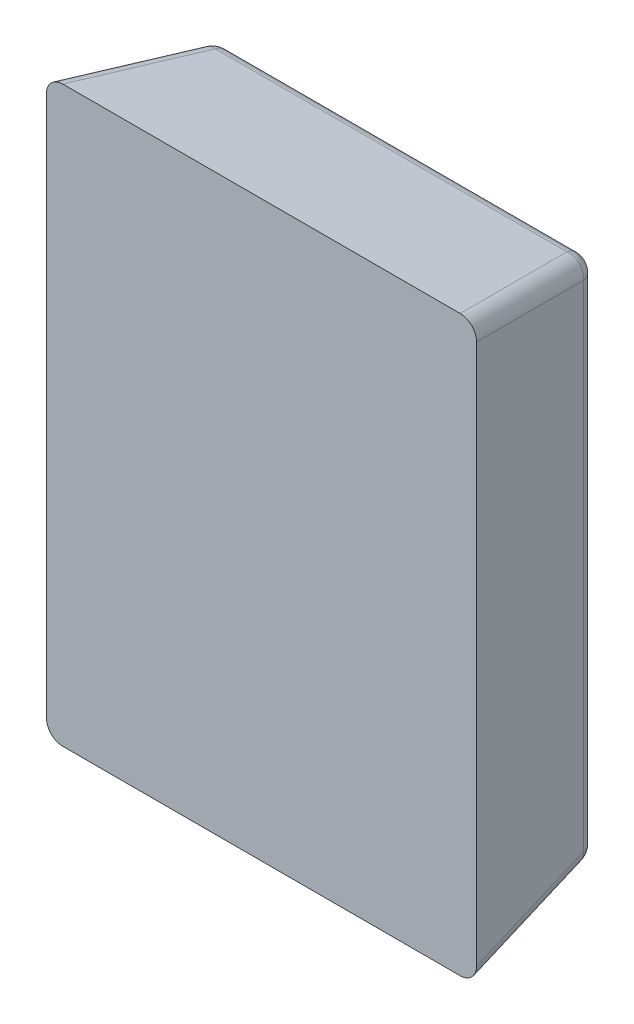
ISO-10303-21;
HEADER;
FILE_DESCRIPTION(('STEP AP214'),'2;1');
FILE_NAME('part.step','',(''),(''),'','','');
FILE_SCHEMA(('AUTOMOTIVE_DESIGN { 1 0 10303 214 1 1 1 1 }'));
ENDSEC;
DATA;
#1=APPLICATION_CONTEXT('core data for automotive mechanical design processes');
#2=APPLICATION_PROTOCOL_DEFINITION('international standard','automotive_design',2000,#1);
#3=PRODUCT_CONTEXT('',#1,'mechanical');
#4=PRODUCT('Part','Part','',(#3));
#5=PRODUCT_RELATED_PRODUCT_CATEGORY('part','',(#4));
#6=PRODUCT_DEFINITION_FORMATION('','',#4);
#7=PRODUCT_DEFINITION_CONTEXT('part definition',#1,'design');
#8=PRODUCT_DEFINITION('design','',#6,#7);
#9=PRODUCT_DEFINITION_SHAPE('','',#8);
#10=(LENGTH_UNIT() NAMED_UNIT(*) SI_UNIT(.MILLI.,.METRE.));
#11=(NAMED_UNIT(*) PLANE_ANGLE_UNIT() SI_UNIT($,.RADIAN.));
#12=(NAMED_UNIT(*) SI_UNIT($,.STERADIAN.) SOLID_ANGLE_UNIT());
#13=UNCERTAINTY_MEASURE_WITH_UNIT(LENGTH_MEASURE(1.E-05),#10,'distance_accuracy_value','');
#14=(GEOMETRIC_REPRESENTATION_CONTEXT(3) GLOBAL_UNCERTAINTY_ASSIGNED_CONTEXT((#13)) GLOBAL_UNIT_ASSIGNED_CONTEXT((#10,
#11,#12)) REPRESENTATION_CONTEXT('',''));
#15=CARTESIAN_POINT('',(0.,0.,0.));
#16=DIRECTION('',(0.,0.,1.));
#17=DIRECTION('',(1.,0.,0.));
#18=AXIS2_PLACEMENT_3D('',#15,#16,#17);
#19=CARTESIAN_POINT('',(0.464535714690616,-0.641019643054923,0.105));
#20=DIRECTION('',(0.,0.,-1.));
#21=DIRECTION('',(-1.,0.,0.));
#22=AXIS2_PLACEMENT_3D('',#19,#20,#21);
#23=PLANE('',#22);
#24=DIRECTION('',(0.,-1.,0.));
#25=VECTOR('',#24,1.);
#26=CARTESIAN_POINT('',(0.538082398429868,-0.701017157850477,0.105));
#27=LINE('',#26,#25);
#28=CARTESIAN_POINT('',(0.538082398429869,-0.744561356385283,0.105));
#29=VERTEX_POINT('',#28);
#30=CARTESIAN_POINT('',(0.538082398429868,-0.537477929724562,0.105));
#31=VERTEX_POINT('',#30);
#32=EDGE_CURVE('E134',#29,#31,#27,.F.);
#33=ORIENTED_EDGE('',*,*,#32,.F.);
#34=DIRECTION('',(-1.,0.,0.));
#35=VECTOR('',#34,1.);
#36=CARTESIAN_POINT('',(0.419535714690616,-0.744561356385283,0.105));
#37=LINE('',#36,#35);
#38=CARTESIAN_POINT('',(0.390989030951365,-0.744561356385283,0.105));
#39=VERTEX_POINT('',#38);
#40=EDGE_CURVE('E237',#39,#29,#37,.F.);
#41=ORIENTED_EDGE('',*,*,#40,.F.);
#42=DIRECTION('',(0.,1.,0.));
#43=VECTOR('',#42,1.);
#44=CARTESIAN_POINT('',(0.390989030951365,-0.581022128259368,0.105));
#45=LINE('',#44,#43);
#46=CARTESIAN_POINT('',(0.390989030951365,-0.537477929724562,0.105));
#47=VERTEX_POINT('',#46);
#48=EDGE_CURVE('E140',#47,#39,#45,.F.);
#49=ORIENTED_EDGE('',*,*,#48,.F.);
#50=DIRECTION('',(1.,0.,0.));
#51=VECTOR('',#50,1.);
#52=CARTESIAN_POINT('',(0.509535714690617,-0.537477929724562,0.105));
#53=LINE('',#52,#51);
#54=EDGE_CURVE('E114',#31,#47,#53,.F.);
#55=ORIENTED_EDGE('',*,*,#54,.F.);
#56=EDGE_LOOP('',(#33,#41,#49,#55));
#57=FACE_BOUND('',#56,.T.);
#58=ADVANCED_FACE('F17',(#57),#23,.T.);
#59=CARTESIAN_POINT('',(0.390989030951365,-0.581022128259368,0.112));
#60=DIRECTION('',(0.,1.,0.));
#61=DIRECTION('',(-1.,0.,0.));
#62=AXIS2_PLACEMENT_3D('',#59,#60,#61);
#63=CYLINDRICAL_SURFACE('',#62,0.007);
#64=DIRECTION('',(0.,1.,0.));
#65=VECTOR('',#64,1.);
#66=CARTESIAN_POINT('',(0.384095376680279,-0.521024613463813,0.110784462756331));
#67=LINE('',#66,#65);
#68=CARTESIAN_POINT('',(0.38409537668028,-0.537477929724562,0.110784462756331));
#69=VERTEX_POINT('',#68);
#70=CARTESIAN_POINT('',(0.38409537668028,-0.744561356385283,0.110784462756331));
#71=VERTEX_POINT('',#70);
#72=EDGE_CURVE('E183',#69,#71,#67,.F.);
#73=ORIENTED_EDGE('',*,*,#72,.F.);
#74=CARTESIAN_POINT('',(0.390989030951365,-0.537477929724562,0.112));
#75=DIRECTION('',(0.,1.,0.));
#76=DIRECTION('',(1.,0.,0.));
#77=AXIS2_PLACEMENT_3D('',#74,#75,#76);
#78=CIRCLE('',#77,0.007);
#79=EDGE_CURVE('E103',#47,#69,#78,.T.);
#80=ORIENTED_EDGE('',*,*,#79,.F.);
#81=ORIENTED_EDGE('',*,*,#48,.T.);
#82=CARTESIAN_POINT('',(0.390989030951366,-0.744561356385283,0.112));
#83=DIRECTION('',(0.,1.,0.));
#84=DIRECTION('',(1.,0.,0.));
#85=AXIS2_PLACEMENT_3D('',#82,#83,#84);
#86=CIRCLE('',#85,0.007);
#87=EDGE_CURVE('E90',#71,#39,#86,.F.);
#88=ORIENTED_EDGE('',*,*,#87,.F.);
#89=EDGE_LOOP('',(#73,#80,#81,#88));
#90=FACE_BOUND('',#89,.T.);
#91=ADVANCED_FACE('F229',(#90),#63,.T.);
#92=CARTESIAN_POINT('',(0.390989030951365,-0.537477929724562,0.112));
#93=DIRECTION('',(1.,0.,0.));
#94=DIRECTION('',(0.,1.,0.));
#95=AXIS2_PLACEMENT_3D('',#92,#93,#94);
#96=SPHERICAL_SURFACE('',#95,0.007);
#97=ORIENTED_EDGE('',*,*,#79,.T.);
#98=CARTESIAN_POINT('',(0.390989030951366,-0.537477929724562,0.112));
#99=DIRECTION('',(-0.17108786974604,0.171087869746041,0.970287525247812));
#100=DIRECTION('',(0.,-0.984807753012207,0.173648177666936));
#101=AXIS2_PLACEMENT_3D('',#98,#99,#100);
#102=CIRCLE('',#101,0.007);
#103=CARTESIAN_POINT('',(0.390989030951365,-0.530584275453477,0.110784462756331));
#104=VERTEX_POINT('',#103);
#105=EDGE_CURVE('E20',#104,#69,#102,.T.);
#106=ORIENTED_EDGE('',*,*,#105,.F.);
#107=CARTESIAN_POINT('',(0.390989030951365,-0.537477929724562,0.112));
#108=DIRECTION('',(1.,0.,0.));
#109=DIRECTION('',(0.,1.,0.));
#110=AXIS2_PLACEMENT_3D('',#107,#108,#109);
#111=CIRCLE('',#110,0.007);
#112=EDGE_CURVE('E122',#47,#104,#111,.T.);
#113=ORIENTED_EDGE('',*,*,#112,.F.);
#114=EDGE_LOOP('',(#97,#106,#113));
#115=FACE_BOUND('',#114,.T.);
#116=ADVANCED_FACE('F226',(#115),#96,.T.);
#117=CARTESIAN_POINT('',(0.509535714690617,-0.537477929724562,0.112));
#118=DIRECTION('',(1.,0.,0.));
#119=DIRECTION('',(0.,1.,0.));
#120=AXIS2_PLACEMENT_3D('',#117,#118,#119);
#121=CYLINDRICAL_SURFACE('',#120,0.007);
#122=DIRECTION('',(1.,0.,0.));
#123=VECTOR('',#122,1.);
#124=CARTESIAN_POINT('',(0.554535714690617,-0.530584275453476,0.110784462756331));
#125=LINE('',#124,#123);
#126=CARTESIAN_POINT('',(0.538082398429868,-0.530584275453476,0.110784462756331));
#127=VERTEX_POINT('',#126);
#128=EDGE_CURVE('E117',#127,#104,#125,.F.);
#129=ORIENTED_EDGE('',*,*,#128,.F.);
#130=CARTESIAN_POINT('',(0.538082398429868,-0.537477929724562,0.112));
#131=DIRECTION('',(1.,0.,0.));
#132=DIRECTION('',(0.,1.,0.));
#133=AXIS2_PLACEMENT_3D('',#130,#131,#132);
#134=CIRCLE('',#133,0.00699999999999995);
#135=EDGE_CURVE('E110',#31,#127,#134,.T.);
#136=ORIENTED_EDGE('',*,*,#135,.F.);
#137=ORIENTED_EDGE('',*,*,#54,.T.);
#138=ORIENTED_EDGE('',*,*,#112,.T.);
#139=EDGE_LOOP('',(#129,#136,#137,#138));
#140=FACE_BOUND('',#139,.T.);
#141=ADVANCED_FACE('F112',(#140),#121,.T.);
#142=CARTESIAN_POINT('',(0.538082398429868,-0.537477929724562,0.112));
#143=DIRECTION('',(1.,0.,0.));
#144=DIRECTION('',(0.,1.,0.));
#145=AXIS2_PLACEMENT_3D('',#142,#143,#144);
#146=SPHERICAL_SURFACE('',#145,0.007);
#147=ORIENTED_EDGE('',*,*,#135,.T.);
#148=CARTESIAN_POINT('',(0.538082398429869,-0.537477929724561,0.111999999999999));
#149=DIRECTION('',(0.171087869746028,0.171087869746031,0.970287525247816));
#150=DIRECTION('',(0.,-0.984807753012209,0.173648177666926));
#151=AXIS2_PLACEMENT_3D('',#148,#149,#150);
#152=CIRCLE('',#151,0.007);
#153=CARTESIAN_POINT('',(0.544976052700953,-0.537477929724562,0.110784462756331));
#154=VERTEX_POINT('',#153);
#155=EDGE_CURVE('E126',#154,#127,#152,.T.);
#156=ORIENTED_EDGE('',*,*,#155,.F.);
#157=CARTESIAN_POINT('',(0.538082398429868,-0.537477929724562,0.112));
#158=DIRECTION('',(0.,-1.,0.));
#159=DIRECTION('',(1.,0.,0.));
#160=AXIS2_PLACEMENT_3D('',#157,#158,#159);
#161=CIRCLE('',#160,0.007);
#162=EDGE_CURVE('E121',#31,#154,#161,.T.);
#163=ORIENTED_EDGE('',*,*,#162,.F.);
#164=EDGE_LOOP('',(#147,#156,#163));
#165=FACE_BOUND('',#164,.T.);
#166=ADVANCED_FACE('F125',(#165),#146,.T.);
#167=CARTESIAN_POINT('',(0.538082398429868,-0.701017157850477,0.112));
#168=DIRECTION('',(0.,-1.,0.));
#169=DIRECTION('',(1.,0.,0.));
#170=AXIS2_PLACEMENT_3D('',#167,#168,#169);
#171=CYLINDRICAL_SURFACE('',#170,0.007);
#172=DIRECTION('',(0.,1.,0.));
#173=VECTOR('',#172,1.);
#174=CARTESIAN_POINT('',(0.544976052700954,-0.761014672646032,0.110784462756331));
#175=LINE('',#174,#173);
#176=CARTESIAN_POINT('',(0.544976052700954,-0.744561356385283,0.110784462756331));
#177=VERTEX_POINT('',#176);
#178=EDGE_CURVE('E165',#177,#154,#175,.T.);
#179=ORIENTED_EDGE('',*,*,#178,.F.);
#180=CARTESIAN_POINT('',(0.538082398429869,-0.744561356385283,0.112));
#181=DIRECTION('',(0.,1.,0.));
#182=DIRECTION('',(1.,0.,0.));
#183=AXIS2_PLACEMENT_3D('',#180,#181,#182);
#184=CIRCLE('',#183,0.007);
#185=EDGE_CURVE('E131',#29,#177,#184,.F.);
#186=ORIENTED_EDGE('',*,*,#185,.F.);
#187=ORIENTED_EDGE('',*,*,#32,.T.);
#188=ORIENTED_EDGE('',*,*,#162,.T.);
#189=EDGE_LOOP('',(#179,#186,#187,#188));
#190=FACE_BOUND('',#189,.T.);
#191=ADVANCED_FACE('F135',(#190),#171,.T.);
#192=CARTESIAN_POINT('',(0.538082398429869,-0.744561356385283,0.112));
#193=DIRECTION('',(1.,0.,0.));
#194=DIRECTION('',(0.,1.,0.));
#195=AXIS2_PLACEMENT_3D('',#192,#193,#194);
#196=SPHERICAL_SURFACE('',#195,0.007);
#197=CARTESIAN_POINT('',(0.538082398429869,-0.744561356385283,0.112));
#198=DIRECTION('',(-1.,0.,0.));
#199=DIRECTION('',(0.,-1.,0.));
#200=AXIS2_PLACEMENT_3D('',#197,#198,#199);
#201=CIRCLE('',#200,0.007);
#202=CARTESIAN_POINT('',(0.538082398429869,-0.751455010656368,0.110784462756331));
#203=VERTEX_POINT('',#202);
#204=EDGE_CURVE('E216',#29,#203,#201,.T.);
#205=ORIENTED_EDGE('',*,*,#204,.F.);
#206=ORIENTED_EDGE('',*,*,#185,.T.);
#207=CARTESIAN_POINT('',(0.538082398429869,-0.744561356385283,0.112));
#208=DIRECTION('',(0.171087869746032,-0.171087869746034,0.970287525247815));
#209=DIRECTION('',(0.,-0.984807753012208,-0.173648177666929));
#210=AXIS2_PLACEMENT_3D('',#207,#208,#209);
#211=CIRCLE('',#210,0.007);
#212=EDGE_CURVE('E162',#203,#177,#211,.T.);
#213=ORIENTED_EDGE('',*,*,#212,.F.);
#214=EDGE_LOOP('',(#205,#206,#213));
#215=FACE_BOUND('',#214,.T.);
#216=ADVANCED_FACE('F204',(#215),#196,.T.);
#217=CARTESIAN_POINT('',(0.419535714690616,-0.744561356385283,0.112));
#218=DIRECTION('',(-1.,0.,0.));
#219=DIRECTION('',(0.,-1.,0.));
#220=AXIS2_PLACEMENT_3D('',#217,#218,#219);
#221=CYLINDRICAL_SURFACE('',#220,0.007);
#222=DIRECTION('',(1.,0.,0.));
#223=VECTOR('',#222,1.);
#224=CARTESIAN_POINT('',(0.374535714690617,-0.751455010656368,0.110784462756331));
#225=LINE('',#224,#223);
#226=CARTESIAN_POINT('',(0.390989030951366,-0.751455010656369,0.110784462756331));
#227=VERTEX_POINT('',#226);
#228=EDGE_CURVE('E163',#227,#203,#225,.T.);
#229=ORIENTED_EDGE('',*,*,#228,.F.);
#230=CARTESIAN_POINT('',(0.390989030951366,-0.744561356385283,0.112));
#231=DIRECTION('',(1.,0.,0.));
#232=DIRECTION('',(0.,1.,0.));
#233=AXIS2_PLACEMENT_3D('',#230,#231,#232);
#234=CIRCLE('',#233,0.00699999999999995);
#235=EDGE_CURVE('E98',#39,#227,#234,.F.);
#236=ORIENTED_EDGE('',*,*,#235,.F.);
#237=ORIENTED_EDGE('',*,*,#40,.T.);
#238=ORIENTED_EDGE('',*,*,#204,.T.);
#239=EDGE_LOOP('',(#229,#236,#237,#238));
#240=FACE_BOUND('',#239,.T.);
#241=ADVANCED_FACE('F199',(#240),#221,.T.);
#242=CARTESIAN_POINT('',(0.390989030951366,-0.744561356385283,0.112));
#243=DIRECTION('',(1.,0.,0.));
#244=DIRECTION('',(0.,1.,0.));
#245=AXIS2_PLACEMENT_3D('',#242,#243,#244);
#246=SPHERICAL_SURFACE('',#245,0.007);
#247=ORIENTED_EDGE('',*,*,#87,.T.);
#248=ORIENTED_EDGE('',*,*,#235,.T.);
#249=CARTESIAN_POINT('',(0.390989030951366,-0.744561356385283,0.112));
#250=DIRECTION('',(-0.171087869746039,-0.171087869746042,0.970287525247812));
#251=DIRECTION('',(0.,-0.984807753012207,-0.173648177666937));
#252=AXIS2_PLACEMENT_3D('',#249,#250,#251);
#253=CIRCLE('',#252,0.007);
#254=EDGE_CURVE('E158',#71,#227,#253,.T.);
#255=ORIENTED_EDGE('',*,*,#254,.F.);
#256=EDGE_LOOP('',(#247,#248,#255));
#257=FACE_BOUND('',#256,.T.);
#258=ADVANCED_FACE('F194',(#257),#246,.T.);
#259=CARTESIAN_POINT('',(0.374535714690616,-0.521024613463813,0.165));
#260=DIRECTION('',(-0.984807753012208,0.,-0.173648177666929));
#261=DIRECTION('',(-0.173648177666929,0.,0.984807753012208));
#262=AXIS2_PLACEMENT_3D('',#259,#260,#261);
#263=PLANE('',#262);
#264=DIRECTION('',(-0.17108786974604,0.171087869746041,0.970287525247812));
#265=VECTOR('',#264,1.);
#266=CARTESIAN_POINT('',(0.376968325454203,-0.530350878498484,0.15120397880227));
#267=LINE('',#266,#265);
#268=CARTESIAN_POINT('',(0.374535714690617,-0.527918267734898,0.165));
#269=VERTEX_POINT('',#268);
#270=EDGE_CURVE('E181',#69,#269,#267,.T.);
#271=ORIENTED_EDGE('',*,*,#270,.F.);
#272=ORIENTED_EDGE('',*,*,#72,.T.);
#273=DIRECTION('',(-0.171087869746032,-0.171087869746046,0.970287525247813));
#274=VECTOR('',#273,1.);
#275=CARTESIAN_POINT('',(0.38409537668028,-0.744561356385283,0.110784462756331));
#276=LINE('',#275,#274);
#277=CARTESIAN_POINT('',(0.374535714690617,-0.754121018374947,0.165));
#278=VERTEX_POINT('',#277);
#279=EDGE_CURVE('E186',#71,#278,#276,.T.);
#280=ORIENTED_EDGE('',*,*,#279,.T.);
#281=DIRECTION('',(0.,1.,0.));
#282=VECTOR('',#281,1.);
#283=CARTESIAN_POINT('',(0.374535714690617,-0.641019643054923,0.165));
#284=LINE('',#283,#282);
#285=EDGE_CURVE('E155',#278,#269,#284,.T.);
#286=ORIENTED_EDGE('',*,*,#285,.T.);
#287=EDGE_LOOP('',(#271,#272,#280,#286));
#288=FACE_BOUND('',#287,.T.);
#289=ADVANCED_FACE('F198',(#288),#263,.T.);
#290=CARTESIAN_POINT('',(0.383861979725288,-0.530350878498484,0.152419516045939));
#291=DIRECTION('',(-0.17108786974604,0.171087869746041,0.970287525247812));
#292=DIRECTION('',(0.,-0.984807753012207,0.173648177666936));
#293=AXIS2_PLACEMENT_3D('',#290,#291,#292);
#294=CYLINDRICAL_SURFACE('',#293,0.007);
#295=DIRECTION('',(-0.171087869746027,0.171087869746036,0.970287525247815));
#296=VECTOR('',#295,1.);
#297=CARTESIAN_POINT('',(0.390989030951365,-0.530584275453477,0.110784462756331));
#298=LINE('',#297,#296);
#299=CARTESIAN_POINT('',(0.381429368961702,-0.521024613463813,0.165));
#300=VERTEX_POINT('',#299);
#301=EDGE_CURVE('E172',#104,#300,#298,.T.);
#302=ORIENTED_EDGE('',*,*,#301,.F.);
#303=ORIENTED_EDGE('',*,*,#105,.T.);
#304=ORIENTED_EDGE('',*,*,#270,.T.);
#305=CARTESIAN_POINT('',(0.381643700973817,-0.528132599747013,0.165));
#306=DIRECTION('',(0.,0.,-1.));
#307=DIRECTION('',(-0.707106781186545,0.707106781186551,0.));
#308=AXIS2_PLACEMENT_3D('',#305,#306,#307);
#309=ELLIPSE('',#308,0.00721435638184897,0.007);
#310=EDGE_CURVE('E153',#269,#300,#309,.T.);
#311=ORIENTED_EDGE('',*,*,#310,.T.);
#312=EDGE_LOOP('',(#302,#303,#304,#311));
#313=FACE_BOUND('',#312,.T.);
#314=ADVANCED_FACE('F273',(#313),#294,.T.);
#315=CARTESIAN_POINT('',(0.554535714690617,-0.521024613463813,0.165));
#316=DIRECTION('',(0.,0.984807753012208,-0.17364817766693));
#317=DIRECTION('',(0.,0.17364817766693,0.984807753012208));
#318=AXIS2_PLACEMENT_3D('',#315,#316,#317);
#319=PLANE('',#318);
#320=DIRECTION('',(0.171087869746028,0.171087869746031,0.970287525247816));
#321=VECTOR('',#320,1.);
#322=CARTESIAN_POINT('',(0.544331463369851,-0.524335210513493,0.146224671140071));
#323=LINE('',#322,#321);
#324=CARTESIAN_POINT('',(0.547642060419531,-0.521024613463813,0.165));
#325=VERTEX_POINT('',#324);
#326=EDGE_CURVE('E166',#127,#325,#323,.T.);
#327=ORIENTED_EDGE('',*,*,#326,.F.);
#328=ORIENTED_EDGE('',*,*,#128,.T.);
#329=ORIENTED_EDGE('',*,*,#301,.T.);
#330=DIRECTION('',(-1.,0.,0.));
#331=VECTOR('',#330,1.);
#332=CARTESIAN_POINT('',(0.464535714690616,-0.521024613463813,0.165));
#333=LINE('',#332,#331);
#334=EDGE_CURVE('E152',#300,#325,#333,.F.);
#335=ORIENTED_EDGE('',*,*,#334,.T.);
#336=EDGE_LOOP('',(#327,#328,#329,#335));
#337=FACE_BOUND('',#336,.T.);
#338=ADVANCED_FACE('F272',(#337),#319,.T.);
#339=CARTESIAN_POINT('',(0.544331463369852,-0.531228864784578,0.147440208383739));
#340=DIRECTION('',(0.171087869746028,0.171087869746031,0.970287525247816));
#341=DIRECTION('',(0.,-0.984807753012209,0.173648177666926));
#342=AXIS2_PLACEMENT_3D('',#339,#340,#341);
#343=CYLINDRICAL_SURFACE('',#342,0.007);
#344=DIRECTION('',(0.171087869746032,0.171087869746044,0.970287525247813));
#345=VECTOR('',#344,1.);
#346=CARTESIAN_POINT('',(0.544976052700953,-0.537477929724562,0.110784462756331));
#347=LINE('',#346,#345);
#348=CARTESIAN_POINT('',(0.554535714690617,-0.527918267734898,0.165));
#349=VERTEX_POINT('',#348);
#350=EDGE_CURVE('E168',#154,#349,#347,.T.);
#351=ORIENTED_EDGE('',*,*,#350,.F.);
#352=ORIENTED_EDGE('',*,*,#155,.T.);
#353=ORIENTED_EDGE('',*,*,#326,.T.);
#354=CARTESIAN_POINT('',(0.547427728407417,-0.528132599747013,0.165));
#355=DIRECTION('',(0.,0.,-1.));
#356=DIRECTION('',(0.707106781186542,0.707106781186553,0.));
#357=AXIS2_PLACEMENT_3D('',#354,#355,#356);
#358=ELLIPSE('',#357,0.00721435638184894,0.007);
#359=EDGE_CURVE('E150',#325,#349,#358,.T.);
#360=ORIENTED_EDGE('',*,*,#359,.T.);
#361=EDGE_LOOP('',(#351,#352,#353,#360));
#362=FACE_BOUND('',#361,.T.);
#363=ADVANCED_FACE('F293',(#362),#343,.T.);
#364=CARTESIAN_POINT('',(0.554535714690617,-0.761014672646032,0.165));
#365=DIRECTION('',(0.984807753012208,0.,-0.173648177666928));
#366=DIRECTION('',(-0.173648177666928,0.,-0.984807753012208));
#367=AXIS2_PLACEMENT_3D('',#364,#365,#366);
#368=PLANE('',#367);
#369=ORIENTED_EDGE('',*,*,#350,.T.);
#370=DIRECTION('',(0.,1.,0.));
#371=VECTOR('',#370,1.);
#372=CARTESIAN_POINT('',(0.554535714690617,-0.641019643054923,0.165));
#373=LINE('',#372,#371);
#374=CARTESIAN_POINT('',(0.554535714690618,-0.754121018374946,0.165));
#375=VERTEX_POINT('',#374);
#376=EDGE_CURVE('E149',#349,#375,#373,.F.);
#377=ORIENTED_EDGE('',*,*,#376,.T.);
#378=DIRECTION('',(0.171087869746032,-0.171087869746034,0.970287525247815));
#379=VECTOR('',#378,1.);
#380=CARTESIAN_POINT('',(0.552103103927032,-0.751688407611361,0.151203978802271));
#381=LINE('',#380,#379);
#382=EDGE_CURVE('E164',#177,#375,#381,.T.);
#383=ORIENTED_EDGE('',*,*,#382,.F.);
#384=ORIENTED_EDGE('',*,*,#178,.T.);
#385=EDGE_LOOP('',(#369,#377,#383,#384));
#386=FACE_BOUND('',#385,.T.);
#387=ADVANCED_FACE('F267',(#386),#368,.T.);
#388=CARTESIAN_POINT('',(0.545209449655947,-0.751688407611361,0.152419516045939));
#389=DIRECTION('',(0.171087869746032,-0.171087869746034,0.970287525247815));
#390=DIRECTION('',(0.,-0.984807753012208,-0.173648177666929));
#391=AXIS2_PLACEMENT_3D('',#388,#389,#390);
#392=CYLINDRICAL_SURFACE('',#391,0.007);
#393=DIRECTION('',(0.171087869746029,-0.171087869746037,0.970287525247815));
#394=VECTOR('',#393,1.);
#395=CARTESIAN_POINT('',(0.538082398429869,-0.751455010656368,0.110784462756331));
#396=LINE('',#395,#394);
#397=CARTESIAN_POINT('',(0.547642060419532,-0.761014672646032,0.165));
#398=VERTEX_POINT('',#397);
#399=EDGE_CURVE('E161',#203,#398,#396,.T.);
#400=ORIENTED_EDGE('',*,*,#399,.F.);
#401=ORIENTED_EDGE('',*,*,#212,.T.);
#402=ORIENTED_EDGE('',*,*,#382,.T.);
#403=CARTESIAN_POINT('',(0.547427728407418,-0.753906686362832,0.165));
#404=DIRECTION('',(0.,0.,-1.));
#405=DIRECTION('',(0.707106781186544,-0.707106781186551,0.));
#406=AXIS2_PLACEMENT_3D('',#403,#404,#405);
#407=ELLIPSE('',#406,0.00721435638184896,0.007);
#408=EDGE_CURVE('E26',#375,#398,#407,.T.);
#409=ORIENTED_EDGE('',*,*,#408,.T.);
#410=EDGE_LOOP('',(#400,#401,#402,#409));
#411=FACE_BOUND('',#410,.T.);
#412=ADVANCED_FACE('F257',(#411),#392,.T.);
#413=CARTESIAN_POINT('',(0.374535714690617,-0.761014672646032,0.165));
#414=DIRECTION('',(0.,-0.984807753012208,-0.173648177666931));
#415=DIRECTION('',(0.,0.173648177666931,-0.984807753012208));
#416=AXIS2_PLACEMENT_3D('',#413,#414,#415);
#417=PLANE('',#416);
#418=ORIENTED_EDGE('',*,*,#399,.T.);
#419=DIRECTION('',(-1.,0.,0.));
#420=VECTOR('',#419,1.);
#421=CARTESIAN_POINT('',(0.464535714690616,-0.761014672646032,0.165));
#422=LINE('',#421,#420);
#423=CARTESIAN_POINT('',(0.381429368961702,-0.761014672646032,0.165));
#424=VERTEX_POINT('',#423);
#425=EDGE_CURVE('E11',#398,#424,#422,.T.);
#426=ORIENTED_EDGE('',*,*,#425,.T.);
#427=DIRECTION('',(-0.171087869746039,-0.171087869746042,0.970287525247812));
#428=VECTOR('',#427,1.);
#429=CARTESIAN_POINT('',(0.384739966011382,-0.757704075596352,0.146224671140069));
#430=LINE('',#429,#428);
#431=EDGE_CURVE('E157',#227,#424,#430,.T.);
#432=ORIENTED_EDGE('',*,*,#431,.F.);
#433=ORIENTED_EDGE('',*,*,#228,.T.);
#434=EDGE_LOOP('',(#418,#426,#432,#433));
#435=FACE_BOUND('',#434,.T.);
#436=ADVANCED_FACE('F254',(#435),#417,.T.);
#437=CARTESIAN_POINT('',(0.384739966011382,-0.750810421325267,0.147440208383738));
#438=DIRECTION('',(-0.171087869746039,-0.171087869746042,0.970287525247812));
#439=DIRECTION('',(0.,-0.984807753012207,-0.173648177666937));
#440=AXIS2_PLACEMENT_3D('',#437,#438,#439);
#441=CYLINDRICAL_SURFACE('',#440,0.007);
#442=ORIENTED_EDGE('',*,*,#431,.T.);
#443=CARTESIAN_POINT('',(0.381643700973817,-0.753906686362832,0.165));
#444=DIRECTION('',(0.,0.,-1.));
#445=DIRECTION('',(-0.70710678118654,-0.707106781186555,0.));
#446=AXIS2_PLACEMENT_3D('',#443,#444,#445);
#447=ELLIPSE('',#446,0.00721435638184897,0.007);
#448=EDGE_CURVE('E35',#424,#278,#447,.T.);
#449=ORIENTED_EDGE('',*,*,#448,.T.);
#450=ORIENTED_EDGE('',*,*,#279,.F.);
#451=ORIENTED_EDGE('',*,*,#254,.T.);
#452=EDGE_LOOP('',(#442,#449,#450,#451));
#453=FACE_BOUND('',#452,.T.);
#454=ADVANCED_FACE('F278',(#453),#441,.T.);
#455=CARTESIAN_POINT('',(0.464535714690616,-0.641019643054923,0.165));
#456=DIRECTION('',(0.,0.,-1.));
#457=DIRECTION('',(-1.,0.,0.));
#458=AXIS2_PLACEMENT_3D('',#455,#456,#457);
#459=PLANE('',#458);
#460=ORIENTED_EDGE('',*,*,#425,.F.);
#461=ORIENTED_EDGE('',*,*,#408,.F.);
#462=ORIENTED_EDGE('',*,*,#376,.F.);
#463=ORIENTED_EDGE('',*,*,#359,.F.);
#464=ORIENTED_EDGE('',*,*,#334,.F.);
#465=ORIENTED_EDGE('',*,*,#310,.F.);
#466=ORIENTED_EDGE('',*,*,#285,.F.);
#467=ORIENTED_EDGE('',*,*,#448,.F.);
#468=EDGE_LOOP('',(#460,#461,#462,#463,#464,#465,#466,#467));
#469=FACE_BOUND('',#468,.T.);
#470=ADVANCED_FACE('F268',(#469),#459,.F.);
#471=CLOSED_SHELL('',(#58,#91,#116,#141,#166,#191,#216,#241,#258,#289,#314,#338,#363,#387,#412,
#436,#454,#470));
#472=MANIFOLD_SOLID_BREP('B1',#471);
#473=ADVANCED_BREP_SHAPE_REPRESENTATION('',(#18,#472),#14);
#474=SHAPE_DEFINITION_REPRESENTATION(#9,#473);
ENDSEC;
END-ISO-10303-21;
